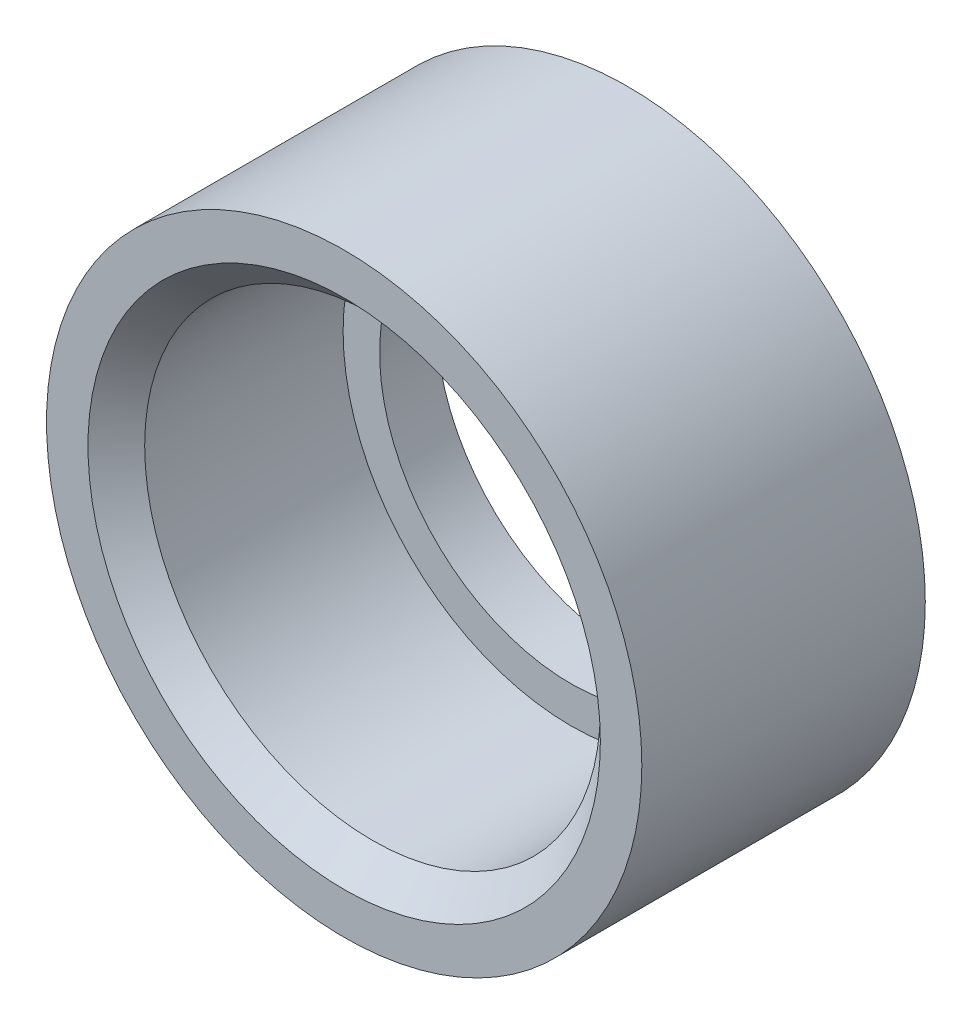
ISO-10303-21;
HEADER;
FILE_DESCRIPTION(('STEP AP214'),'2;1');
FILE_NAME('part.step','',(''),(''),'','','');
FILE_SCHEMA(('AUTOMOTIVE_DESIGN { 1 0 10303 214 1 1 1 1 }'));
ENDSEC;
DATA;
#1=APPLICATION_CONTEXT('core data for automotive mechanical design processes');
#2=APPLICATION_PROTOCOL_DEFINITION('international standard','automotive_design',2000,#1);
#3=PRODUCT_CONTEXT('',#1,'mechanical');
#4=PRODUCT('Part','Part','',(#3));
#5=PRODUCT_RELATED_PRODUCT_CATEGORY('part','',(#4));
#6=PRODUCT_DEFINITION_FORMATION('','',#4);
#7=PRODUCT_DEFINITION_CONTEXT('part definition',#1,'design');
#8=PRODUCT_DEFINITION('design','',#6,#7);
#9=PRODUCT_DEFINITION_SHAPE('','',#8);
#10=(LENGTH_UNIT() NAMED_UNIT(*) SI_UNIT(.MILLI.,.METRE.));
#11=(NAMED_UNIT(*) PLANE_ANGLE_UNIT() SI_UNIT($,.RADIAN.));
#12=(NAMED_UNIT(*) SI_UNIT($,.STERADIAN.) SOLID_ANGLE_UNIT());
#13=UNCERTAINTY_MEASURE_WITH_UNIT(LENGTH_MEASURE(1.E-05),#10,'distance_accuracy_value','');
#14=(GEOMETRIC_REPRESENTATION_CONTEXT(3) GLOBAL_UNCERTAINTY_ASSIGNED_CONTEXT((#13)) GLOBAL_UNIT_ASSIGNED_CONTEXT((#10,
#11,#12)) REPRESENTATION_CONTEXT('',''));
#15=CARTESIAN_POINT('',(0.,0.,0.));
#16=DIRECTION('',(0.,0.,1.));
#17=DIRECTION('',(1.,0.,0.));
#18=AXIS2_PLACEMENT_3D('',#15,#16,#17);
#19=CARTESIAN_POINT('',(0.,0.,5.));
#20=DIRECTION('',(0.,0.,-1.));
#21=DIRECTION('',(-1.,0.,0.));
#22=AXIS2_PLACEMENT_3D('',#19,#20,#21);
#23=CYLINDRICAL_SURFACE('',#22,8.0375);
#24=CARTESIAN_POINT('',(0.,0.,3.99999999999999));
#25=DIRECTION('',(0.,0.,1.));
#26=DIRECTION('',(1.,0.,0.));
#27=AXIS2_PLACEMENT_3D('',#24,#25,#26);
#28=CIRCLE('',#27,8.0375);
#29=CARTESIAN_POINT('',(8.0375,0.,3.99999999999999));
#30=VERTEX_POINT('',#29);
#31=EDGE_CURVE('E55',#30,#30,#28,.T.);
#32=ORIENTED_EDGE('',*,*,#31,.T.);
#33=EDGE_LOOP('',(#32));
#34=FACE_BOUND('',#33,.T.);
#35=CARTESIAN_POINT('',(0.,0.,-3.));
#36=DIRECTION('',(0.,0.,1.));
#37=DIRECTION('',(1.,0.,0.));
#38=AXIS2_PLACEMENT_3D('',#35,#36,#37);
#39=CIRCLE('',#38,8.0375);
#40=CARTESIAN_POINT('',(8.0375,0.,-3.));
#41=VERTEX_POINT('',#40);
#42=EDGE_CURVE('E59',#41,#41,#39,.T.);
#43=ORIENTED_EDGE('',*,*,#42,.F.);
#44=EDGE_LOOP('',(#43));
#45=FACE_BOUND('',#44,.T.);
#46=ADVANCED_FACE('F47',(#34,#45),#23,.F.);
#47=CARTESIAN_POINT('',(0.,0.,5.));
#48=DIRECTION('',(0.,0.,-1.));
#49=DIRECTION('',(-1.,0.,0.));
#50=AXIS2_PLACEMENT_3D('',#47,#48,#49);
#51=CYLINDRICAL_SURFACE('',#50,10.5);
#52=CARTESIAN_POINT('',(0.,0.,5.));
#53=DIRECTION('',(0.,0.,1.));
#54=DIRECTION('',(1.,0.,0.));
#55=AXIS2_PLACEMENT_3D('',#52,#53,#54);
#56=CIRCLE('',#55,10.5);
#57=CARTESIAN_POINT('',(10.5,0.,5.));
#58=VERTEX_POINT('',#57);
#59=EDGE_CURVE('E63',#58,#58,#56,.T.);
#60=ORIENTED_EDGE('',*,*,#59,.F.);
#61=EDGE_LOOP('',(#60));
#62=FACE_BOUND('',#61,.T.);
#63=CARTESIAN_POINT('',(0.,0.,-5.));
#64=DIRECTION('',(0.,0.,1.));
#65=DIRECTION('',(1.,0.,0.));
#66=AXIS2_PLACEMENT_3D('',#63,#64,#65);
#67=CIRCLE('',#66,10.5);
#68=CARTESIAN_POINT('',(10.5,0.,-5.));
#69=VERTEX_POINT('',#68);
#70=EDGE_CURVE('E66',#69,#69,#67,.T.);
#71=ORIENTED_EDGE('',*,*,#70,.T.);
#72=EDGE_LOOP('',(#71));
#73=FACE_BOUND('',#72,.T.);
#74=ADVANCED_FACE('F96',(#62,#73),#51,.T.);
#75=CARTESIAN_POINT('',(0.,0.,5.));
#76=DIRECTION('',(0.,0.,1.));
#77=DIRECTION('',(1.,0.,0.));
#78=AXIS2_PLACEMENT_3D('',#75,#76,#77);
#79=PLANE('',#78);
#80=CARTESIAN_POINT('',(0.,0.,5.));
#81=DIRECTION('',(0.,0.,1.));
#82=DIRECTION('',(1.,0.,0.));
#83=AXIS2_PLACEMENT_3D('',#80,#81,#82);
#84=CIRCLE('',#83,9.03750000000001);
#85=CARTESIAN_POINT('',(9.03750000000001,0.,5.));
#86=VERTEX_POINT('',#85);
#87=EDGE_CURVE('E11',#86,#86,#84,.F.);
#88=ORIENTED_EDGE('',*,*,#87,.T.);
#89=EDGE_LOOP('',(#88));
#90=FACE_BOUND('',#89,.T.);
#91=ORIENTED_EDGE('',*,*,#59,.T.);
#92=EDGE_LOOP('',(#91));
#93=FACE_BOUND('',#92,.T.);
#94=ADVANCED_FACE('F91',(#90,#93),#79,.T.);
#95=CARTESIAN_POINT('',(0.,0.,-5.));
#96=DIRECTION('',(0.,0.,1.));
#97=DIRECTION('',(1.,0.,0.));
#98=AXIS2_PLACEMENT_3D('',#95,#96,#97);
#99=PLANE('',#98);
#100=ORIENTED_EDGE('',*,*,#70,.F.);
#101=EDGE_LOOP('',(#100));
#102=FACE_BOUND('',#101,.T.);
#103=CARTESIAN_POINT('',(0.,0.,-5.));
#104=DIRECTION('',(0.,0.,1.));
#105=DIRECTION('',(1.,0.,0.));
#106=AXIS2_PLACEMENT_3D('',#103,#104,#105);
#107=CIRCLE('',#106,6.75);
#108=CARTESIAN_POINT('',(6.75,0.,-5.));
#109=VERTEX_POINT('',#108);
#110=EDGE_CURVE('E72',#109,#109,#107,.T.);
#111=ORIENTED_EDGE('',*,*,#110,.T.);
#112=EDGE_LOOP('',(#111));
#113=FACE_BOUND('',#112,.T.);
#114=ADVANCED_FACE('F83',(#102,#113),#99,.F.);
#115=CARTESIAN_POINT('',(0.,0.,-3.));
#116=DIRECTION('',(0.,0.,1.));
#117=DIRECTION('',(1.,0.,0.));
#118=AXIS2_PLACEMENT_3D('',#115,#116,#117);
#119=PLANE('',#118);
#120=ORIENTED_EDGE('',*,*,#42,.T.);
#121=EDGE_LOOP('',(#120));
#122=FACE_BOUND('',#121,.T.);
#123=CARTESIAN_POINT('',(0.,0.,-3.));
#124=DIRECTION('',(0.,0.,1.));
#125=DIRECTION('',(1.,0.,0.));
#126=AXIS2_PLACEMENT_3D('',#123,#124,#125);
#127=CIRCLE('',#126,6.75);
#128=CARTESIAN_POINT('',(6.75,0.,-3.));
#129=VERTEX_POINT('',#128);
#130=EDGE_CURVE('E69',#129,#129,#127,.T.);
#131=ORIENTED_EDGE('',*,*,#130,.F.);
#132=EDGE_LOOP('',(#131));
#133=FACE_BOUND('',#132,.T.);
#134=ADVANCED_FACE('F81',(#122,#133),#119,.T.);
#135=CARTESIAN_POINT('',(0.,0.,-3.));
#136=DIRECTION('',(0.,0.,-1.));
#137=DIRECTION('',(-1.,0.,0.));
#138=AXIS2_PLACEMENT_3D('',#135,#136,#137);
#139=CYLINDRICAL_SURFACE('',#138,6.75);
#140=ORIENTED_EDGE('',*,*,#130,.T.);
#141=EDGE_LOOP('',(#140));
#142=FACE_BOUND('',#141,.T.);
#143=ORIENTED_EDGE('',*,*,#110,.F.);
#144=EDGE_LOOP('',(#143));
#145=FACE_BOUND('',#144,.T.);
#146=ADVANCED_FACE('F78',(#142,#145),#139,.F.);
#147=CARTESIAN_POINT('',(0.,0.,3.99999999999999));
#148=DIRECTION('',(0.,0.,1.));
#149=DIRECTION('',(1.,0.,0.));
#150=AXIS2_PLACEMENT_3D('',#147,#148,#149);
#151=CONICAL_SURFACE('',#150,8.0375,0.785398163397448);
#152=ORIENTED_EDGE('',*,*,#87,.F.);
#153=EDGE_LOOP('',(#152));
#154=FACE_BOUND('',#153,.T.);
#155=ORIENTED_EDGE('',*,*,#31,.F.);
#156=EDGE_LOOP('',(#155));
#157=FACE_BOUND('',#156,.T.);
#158=ADVANCED_FACE('F50',(#154,#157),#151,.F.);
#159=CLOSED_SHELL('',(#46,#74,#94,#114,#134,#146,#158));
#160=MANIFOLD_SOLID_BREP('B2',#159);
#161=ADVANCED_BREP_SHAPE_REPRESENTATION('',(#18,#160),#14);
#162=SHAPE_DEFINITION_REPRESENTATION(#9,#161);
ENDSEC;
END-ISO-10303-21;
